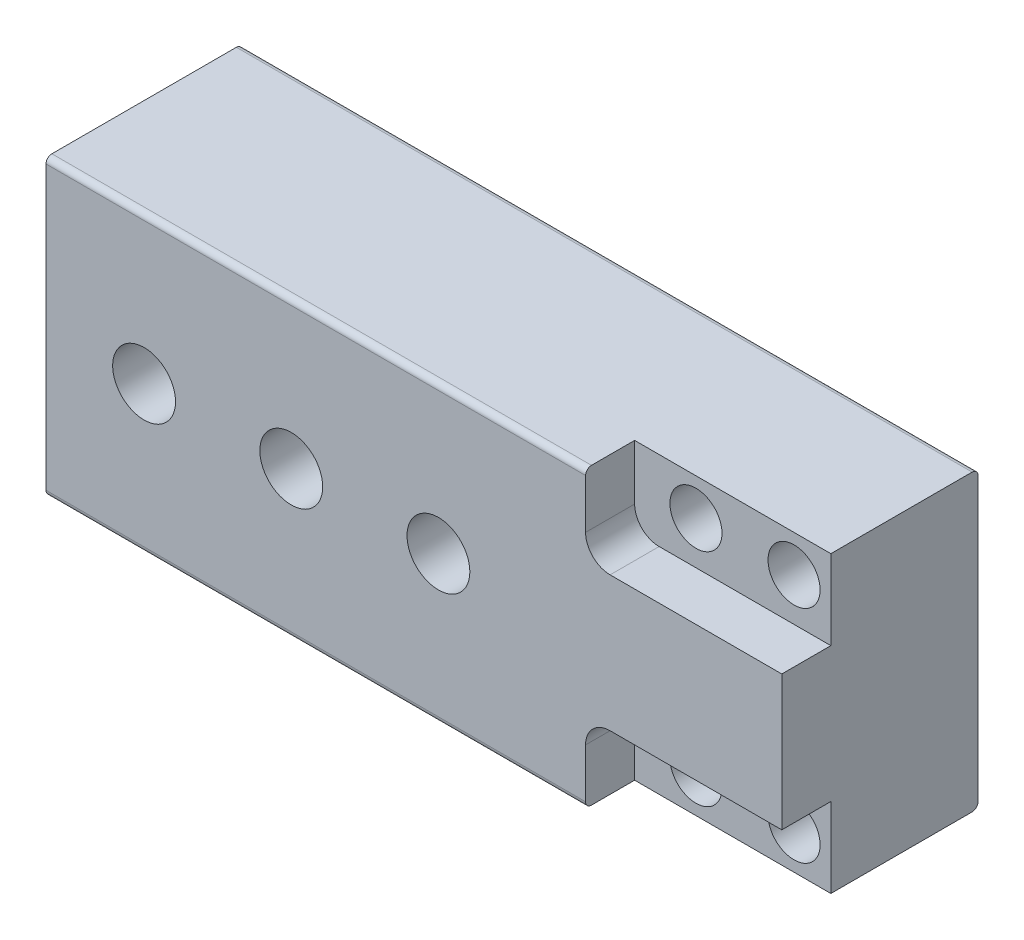
ISO-10303-21;
HEADER;
FILE_DESCRIPTION(('STEP AP214'),'2;1');
FILE_NAME('part.step','',(''),(''),'','','');
FILE_SCHEMA(('AUTOMOTIVE_DESIGN { 1 0 10303 214 1 1 1 1 }'));
ENDSEC;
DATA;
#1=APPLICATION_CONTEXT('core data for automotive mechanical design processes');
#2=APPLICATION_PROTOCOL_DEFINITION('international standard','automotive_design',2000,#1);
#3=PRODUCT_CONTEXT('',#1,'mechanical');
#4=PRODUCT('Part','Part','',(#3));
#5=PRODUCT_RELATED_PRODUCT_CATEGORY('part','',(#4));
#6=PRODUCT_DEFINITION_FORMATION('','',#4);
#7=PRODUCT_DEFINITION_CONTEXT('part definition',#1,'design');
#8=PRODUCT_DEFINITION('design','',#6,#7);
#9=PRODUCT_DEFINITION_SHAPE('','',#8);
#10=(LENGTH_UNIT() NAMED_UNIT(*) SI_UNIT(.MILLI.,.METRE.));
#11=(NAMED_UNIT(*) PLANE_ANGLE_UNIT() SI_UNIT($,.RADIAN.));
#12=(NAMED_UNIT(*) SI_UNIT($,.STERADIAN.) SOLID_ANGLE_UNIT());
#13=UNCERTAINTY_MEASURE_WITH_UNIT(LENGTH_MEASURE(1.E-05),#10,'distance_accuracy_value','');
#14=(GEOMETRIC_REPRESENTATION_CONTEXT(3) GLOBAL_UNCERTAINTY_ASSIGNED_CONTEXT((#13)) GLOBAL_UNIT_ASSIGNED_CONTEXT((#10,
#11,#12)) REPRESENTATION_CONTEXT('',''));
#15=CARTESIAN_POINT('',(0.,0.,0.));
#16=DIRECTION('',(0.,0.,1.));
#17=DIRECTION('',(1.,0.,0.));
#18=AXIS2_PLACEMENT_3D('',#15,#16,#17);
#19=CARTESIAN_POINT('',(85.725,28.575,50.8));
#20=DIRECTION('',(0.,0.,1.));
#21=DIRECTION('',(1.,0.,0.));
#22=AXIS2_PLACEMENT_3D('',#19,#20,#21);
#23=CYLINDRICAL_SURFACE('',#22,6.74369999999999);
#24=CARTESIAN_POINT('',(85.725,28.575,0.));
#25=DIRECTION('',(0.,0.,1.));
#26=DIRECTION('',(1.,0.,0.));
#27=AXIS2_PLACEMENT_3D('',#24,#25,#26);
#28=CIRCLE('',#27,6.74369999999999);
#29=CARTESIAN_POINT('',(92.4687,28.575,0.));
#30=VERTEX_POINT('',#29);
#31=EDGE_CURVE('E225',#30,#30,#28,.T.);
#32=ORIENTED_EDGE('',*,*,#31,.F.);
#33=EDGE_LOOP('',(#32));
#34=FACE_BOUND('',#33,.T.);
#35=CARTESIAN_POINT('',(85.725,28.575,38.1));
#36=DIRECTION('',(0.,0.,1.));
#37=DIRECTION('',(1.,0.,0.));
#38=AXIS2_PLACEMENT_3D('',#35,#36,#37);
#39=CIRCLE('',#38,6.74369999999999);
#40=CARTESIAN_POINT('',(92.4687,28.575,38.1));
#41=VERTEX_POINT('',#40);
#42=EDGE_CURVE('E219',#41,#41,#39,.F.);
#43=ORIENTED_EDGE('',*,*,#42,.F.);
#44=EDGE_LOOP('',(#43));
#45=FACE_BOUND('',#44,.T.);
#46=ADVANCED_FACE('F33',(#34,#45),#23,.F.);
#47=CARTESIAN_POINT('',(60.325,28.575,50.8));
#48=DIRECTION('',(0.,0.,1.));
#49=DIRECTION('',(1.,0.,0.));
#50=AXIS2_PLACEMENT_3D('',#47,#48,#49);
#51=CYLINDRICAL_SURFACE('',#50,6.74369999999999);
#52=CARTESIAN_POINT('',(60.325,28.575,0.));
#53=DIRECTION('',(0.,0.,1.));
#54=DIRECTION('',(1.,0.,0.));
#55=AXIS2_PLACEMENT_3D('',#52,#53,#54);
#56=CIRCLE('',#55,6.74369999999998);
#57=CARTESIAN_POINT('',(67.0687,28.575,0.));
#58=VERTEX_POINT('',#57);
#59=EDGE_CURVE('E222',#58,#58,#56,.T.);
#60=ORIENTED_EDGE('',*,*,#59,.F.);
#61=EDGE_LOOP('',(#60));
#62=FACE_BOUND('',#61,.T.);
#63=CARTESIAN_POINT('',(60.325,28.575,38.1));
#64=DIRECTION('',(0.,0.,1.));
#65=DIRECTION('',(1.,0.,0.));
#66=AXIS2_PLACEMENT_3D('',#63,#64,#65);
#67=CIRCLE('',#66,6.74369999999999);
#68=CARTESIAN_POINT('',(67.0687,28.575,38.1));
#69=VERTEX_POINT('',#68);
#70=EDGE_CURVE('E212',#69,#69,#67,.F.);
#71=ORIENTED_EDGE('',*,*,#70,.F.);
#72=EDGE_LOOP('',(#71));
#73=FACE_BOUND('',#72,.T.);
#74=ADVANCED_FACE('F327',(#62,#73),#51,.F.);
#75=CARTESIAN_POINT('',(-95.25,38.1,50.8));
#76=DIRECTION('',(1.,0.,0.));
#77=DIRECTION('',(0.,0.,-1.));
#78=AXIS2_PLACEMENT_3D('',#75,#76,#77);
#79=PLANE('',#78);
#80=DIRECTION('',(0.,0.,-1.));
#81=VECTOR('',#80,1.);
#82=CARTESIAN_POINT('',(-95.25,38.1,50.8));
#83=LINE('',#82,#81);
#84=CARTESIAN_POINT('',(-95.25,38.1,49.276));
#85=VERTEX_POINT('',#84);
#86=CARTESIAN_POINT('',(-95.25,38.1,1.524));
#87=VERTEX_POINT('',#86);
#88=EDGE_CURVE('E259',#85,#87,#83,.T.);
#89=ORIENTED_EDGE('',*,*,#88,.T.);
#90=CARTESIAN_POINT('',(-95.25,36.576,1.524));
#91=DIRECTION('',(1.,0.,0.));
#92=DIRECTION('',(0.,0.,-1.));
#93=AXIS2_PLACEMENT_3D('',#90,#91,#92);
#94=CIRCLE('',#93,1.524);
#95=CARTESIAN_POINT('',(-95.25,36.576,0.));
#96=VERTEX_POINT('',#95);
#97=EDGE_CURVE('E285',#87,#96,#94,.F.);
#98=ORIENTED_EDGE('',*,*,#97,.T.);
#99=DIRECTION('',(0.,-1.,0.));
#100=VECTOR('',#99,1.);
#101=CARTESIAN_POINT('',(-95.25,38.1,0.));
#102=LINE('',#101,#100);
#103=CARTESIAN_POINT('',(-95.25,-36.576,0.));
#104=VERTEX_POINT('',#103);
#105=EDGE_CURVE('E252',#96,#104,#102,.T.);
#106=ORIENTED_EDGE('',*,*,#105,.T.);
#107=CARTESIAN_POINT('',(-95.25,-36.576,1.524));
#108=DIRECTION('',(1.,0.,0.));
#109=DIRECTION('',(0.,0.,-1.));
#110=AXIS2_PLACEMENT_3D('',#107,#108,#109);
#111=CIRCLE('',#110,1.524);
#112=CARTESIAN_POINT('',(-95.25,-38.1,1.524));
#113=VERTEX_POINT('',#112);
#114=EDGE_CURVE('E283',#104,#113,#111,.F.);
#115=ORIENTED_EDGE('',*,*,#114,.T.);
#116=DIRECTION('',(0.,0.,-1.));
#117=VECTOR('',#116,1.);
#118=CARTESIAN_POINT('',(-95.25,-38.1,50.8));
#119=LINE('',#118,#117);
#120=CARTESIAN_POINT('',(-95.25,-38.1,49.276));
#121=VERTEX_POINT('',#120);
#122=EDGE_CURVE('E270',#121,#113,#119,.T.);
#123=ORIENTED_EDGE('',*,*,#122,.F.);
#124=CARTESIAN_POINT('',(-95.25,-36.576,49.276));
#125=DIRECTION('',(1.,0.,0.));
#126=DIRECTION('',(0.,0.,-1.));
#127=AXIS2_PLACEMENT_3D('',#124,#125,#126);
#128=CIRCLE('',#127,1.524);
#129=CARTESIAN_POINT('',(-95.25,-36.576,50.8));
#130=VERTEX_POINT('',#129);
#131=EDGE_CURVE('E279',#121,#130,#128,.F.);
#132=ORIENTED_EDGE('',*,*,#131,.T.);
#133=DIRECTION('',(0.,-1.,0.));
#134=VECTOR('',#133,1.);
#135=CARTESIAN_POINT('',(-95.25,38.1,50.8));
#136=LINE('',#135,#134);
#137=CARTESIAN_POINT('',(-95.25,36.576,50.8));
#138=VERTEX_POINT('',#137);
#139=EDGE_CURVE('E253',#138,#130,#136,.T.);
#140=ORIENTED_EDGE('',*,*,#139,.F.);
#141=CARTESIAN_POINT('',(-95.25,36.576,49.276));
#142=DIRECTION('',(1.,0.,0.));
#143=DIRECTION('',(0.,0.,-1.));
#144=AXIS2_PLACEMENT_3D('',#141,#142,#143);
#145=CIRCLE('',#144,1.524);
#146=EDGE_CURVE('E281',#138,#85,#145,.F.);
#147=ORIENTED_EDGE('',*,*,#146,.T.);
#148=EDGE_LOOP('',(#89,#98,#106,#115,#123,#132,#140,#147));
#149=FACE_BOUND('',#148,.T.);
#150=ADVANCED_FACE('F333',(#149),#79,.F.);
#151=CARTESIAN_POINT('',(-95.25,-38.1,50.8));
#152=DIRECTION('',(0.,1.,0.));
#153=DIRECTION('',(0.,0.,1.));
#154=AXIS2_PLACEMENT_3D('',#151,#152,#153);
#155=PLANE('',#154);
#156=DIRECTION('',(1.,0.,0.));
#157=VECTOR('',#156,1.);
#158=CARTESIAN_POINT('',(44.45,-38.1,38.1));
#159=LINE('',#158,#157);
#160=CARTESIAN_POINT('',(44.45,-38.1,38.1));
#161=VERTEX_POINT('',#160);
#162=CARTESIAN_POINT('',(95.25,-38.1,38.1));
#163=VERTEX_POINT('',#162);
#164=EDGE_CURVE('E162',#161,#163,#159,.T.);
#165=ORIENTED_EDGE('',*,*,#164,.F.);
#166=DIRECTION('',(0.,0.,1.));
#167=VECTOR('',#166,1.);
#168=CARTESIAN_POINT('',(44.45,-38.1,38.1));
#169=LINE('',#168,#167);
#170=CARTESIAN_POINT('',(44.45,-38.1,49.276));
#171=VERTEX_POINT('',#170);
#172=EDGE_CURVE('E153',#161,#171,#169,.T.);
#173=ORIENTED_EDGE('',*,*,#172,.T.);
#174=DIRECTION('',(1.,0.,0.));
#175=VECTOR('',#174,1.);
#176=CARTESIAN_POINT('',(-95.25,-38.1,49.276));
#177=LINE('',#176,#175);
#178=EDGE_CURVE('E296',#171,#121,#177,.F.);
#179=ORIENTED_EDGE('',*,*,#178,.T.);
#180=ORIENTED_EDGE('',*,*,#122,.T.);
#181=DIRECTION('',(1.,0.,0.));
#182=VECTOR('',#181,1.);
#183=CARTESIAN_POINT('',(-95.25,-38.1,1.524));
#184=LINE('',#183,#182);
#185=CARTESIAN_POINT('',(95.25,-38.1,1.524));
#186=VERTEX_POINT('',#185);
#187=EDGE_CURVE('E298',#113,#186,#184,.T.);
#188=ORIENTED_EDGE('',*,*,#187,.T.);
#189=DIRECTION('',(0.,0.,-1.));
#190=VECTOR('',#189,1.);
#191=CARTESIAN_POINT('',(95.25,-38.1,50.8));
#192=LINE('',#191,#190);
#193=EDGE_CURVE('E268',#163,#186,#192,.T.);
#194=ORIENTED_EDGE('',*,*,#193,.F.);
#195=EDGE_LOOP('',(#165,#173,#179,#180,#188,#194));
#196=FACE_BOUND('',#195,.T.);
#197=ADVANCED_FACE('F386',(#196),#155,.F.);
#198=CARTESIAN_POINT('',(95.25,38.1,50.8));
#199=DIRECTION('',(-1.,0.,0.));
#200=DIRECTION('',(0.,0.,1.));
#201=AXIS2_PLACEMENT_3D('',#198,#199,#200);
#202=PLANE('',#201);
#203=DIRECTION('',(0.,1.,0.));
#204=VECTOR('',#203,1.);
#205=CARTESIAN_POINT('',(95.25,38.1,50.8));
#206=LINE('',#205,#204);
#207=CARTESIAN_POINT('',(95.25,-17.4752,50.8));
#208=VERTEX_POINT('',#207);
#209=CARTESIAN_POINT('',(95.25,17.4752,50.8));
#210=VERTEX_POINT('',#209);
#211=EDGE_CURVE('E256',#208,#210,#206,.T.);
#212=ORIENTED_EDGE('',*,*,#211,.F.);
#213=DIRECTION('',(0.,0.,1.));
#214=VECTOR('',#213,1.);
#215=CARTESIAN_POINT('',(95.25,-17.4752,38.1));
#216=LINE('',#215,#214);
#217=CARTESIAN_POINT('',(95.25,-17.4752,38.1));
#218=VERTEX_POINT('',#217);
#219=EDGE_CURVE('E181',#218,#208,#216,.T.);
#220=ORIENTED_EDGE('',*,*,#219,.F.);
#221=DIRECTION('',(0.,1.,0.));
#222=VECTOR('',#221,1.);
#223=CARTESIAN_POINT('',(95.25,-17.4752,38.1));
#224=LINE('',#223,#222);
#225=EDGE_CURVE('E173',#163,#218,#224,.T.);
#226=ORIENTED_EDGE('',*,*,#225,.F.);
#227=ORIENTED_EDGE('',*,*,#193,.T.);
#228=CARTESIAN_POINT('',(95.25,-36.576,1.524));
#229=DIRECTION('',(-1.,0.,0.));
#230=DIRECTION('',(0.,0.,1.));
#231=AXIS2_PLACEMENT_3D('',#228,#229,#230);
#232=CIRCLE('',#231,1.524);
#233=CARTESIAN_POINT('',(95.25,-36.576,0.));
#234=VERTEX_POINT('',#233);
#235=EDGE_CURVE('E291',#186,#234,#232,.F.);
#236=ORIENTED_EDGE('',*,*,#235,.T.);
#237=DIRECTION('',(0.,1.,0.));
#238=VECTOR('',#237,1.);
#239=CARTESIAN_POINT('',(95.25,38.1,0.));
#240=LINE('',#239,#238);
#241=CARTESIAN_POINT('',(95.25,36.576,0.));
#242=VERTEX_POINT('',#241);
#243=EDGE_CURVE('E257',#234,#242,#240,.T.);
#244=ORIENTED_EDGE('',*,*,#243,.T.);
#245=CARTESIAN_POINT('',(95.25,36.576,1.524));
#246=DIRECTION('',(-1.,0.,0.));
#247=DIRECTION('',(0.,0.,1.));
#248=AXIS2_PLACEMENT_3D('',#245,#246,#247);
#249=CIRCLE('',#248,1.524);
#250=CARTESIAN_POINT('',(95.25,38.1,1.524));
#251=VERTEX_POINT('',#250);
#252=EDGE_CURVE('E293',#242,#251,#249,.F.);
#253=ORIENTED_EDGE('',*,*,#252,.T.);
#254=DIRECTION('',(0.,0.,-1.));
#255=VECTOR('',#254,1.);
#256=CARTESIAN_POINT('',(95.25,38.1,50.8));
#257=LINE('',#256,#255);
#258=CARTESIAN_POINT('',(95.25,38.1,38.1));
#259=VERTEX_POINT('',#258);
#260=EDGE_CURVE('E266',#259,#251,#257,.T.);
#261=ORIENTED_EDGE('',*,*,#260,.F.);
#262=DIRECTION('',(0.,1.,0.));
#263=VECTOR('',#262,1.);
#264=CARTESIAN_POINT('',(95.25,38.1,38.1));
#265=LINE('',#264,#263);
#266=CARTESIAN_POINT('',(95.25,17.4752,38.1));
#267=VERTEX_POINT('',#266);
#268=EDGE_CURVE('E188',#267,#259,#265,.T.);
#269=ORIENTED_EDGE('',*,*,#268,.F.);
#270=DIRECTION('',(0.,0.,1.));
#271=VECTOR('',#270,1.);
#272=CARTESIAN_POINT('',(95.25,17.4752,38.1));
#273=LINE('',#272,#271);
#274=EDGE_CURVE('E209',#267,#210,#273,.T.);
#275=ORIENTED_EDGE('',*,*,#274,.T.);
#276=EDGE_LOOP('',(#212,#220,#226,#227,#236,#244,#253,#261,#269,#275));
#277=FACE_BOUND('',#276,.T.);
#278=ADVANCED_FACE('F382',(#277),#202,.F.);
#279=CARTESIAN_POINT('',(-95.25,38.1,50.8));
#280=DIRECTION('',(0.,-1.,0.));
#281=DIRECTION('',(0.,0.,-1.));
#282=AXIS2_PLACEMENT_3D('',#279,#280,#281);
#283=PLANE('',#282);
#284=DIRECTION('',(-1.,0.,0.));
#285=VECTOR('',#284,1.);
#286=CARTESIAN_POINT('',(95.25,38.1,49.276));
#287=LINE('',#286,#285);
#288=CARTESIAN_POINT('',(44.45,38.1,49.276));
#289=VERTEX_POINT('',#288);
#290=EDGE_CURVE('E273',#85,#289,#287,.F.);
#291=ORIENTED_EDGE('',*,*,#290,.T.);
#292=DIRECTION('',(0.,0.,1.));
#293=VECTOR('',#292,1.);
#294=CARTESIAN_POINT('',(44.45,38.1,38.1));
#295=LINE('',#294,#293);
#296=CARTESIAN_POINT('',(44.45,38.1,38.1));
#297=VERTEX_POINT('',#296);
#298=EDGE_CURVE('E55',#297,#289,#295,.T.);
#299=ORIENTED_EDGE('',*,*,#298,.F.);
#300=DIRECTION('',(-1.,0.,0.));
#301=VECTOR('',#300,1.);
#302=CARTESIAN_POINT('',(95.25,38.1,38.1));
#303=LINE('',#302,#301);
#304=EDGE_CURVE('E190',#259,#297,#303,.T.);
#305=ORIENTED_EDGE('',*,*,#304,.F.);
#306=ORIENTED_EDGE('',*,*,#260,.T.);
#307=DIRECTION('',(-1.,0.,0.));
#308=VECTOR('',#307,1.);
#309=CARTESIAN_POINT('',(-95.25,38.1,1.524));
#310=LINE('',#309,#308);
#311=EDGE_CURVE('E276',#251,#87,#310,.T.);
#312=ORIENTED_EDGE('',*,*,#311,.T.);
#313=ORIENTED_EDGE('',*,*,#88,.F.);
#314=EDGE_LOOP('',(#291,#299,#305,#306,#312,#313));
#315=FACE_BOUND('',#314,.T.);
#316=ADVANCED_FACE('F374',(#315),#283,.F.);
#317=CARTESIAN_POINT('',(-95.25,-38.1,50.8));
#318=DIRECTION('',(0.,0.,1.));
#319=DIRECTION('',(1.,0.,0.));
#320=AXIS2_PLACEMENT_3D('',#317,#318,#319);
#321=PLANE('',#320);
#322=DIRECTION('',(-1.,0.,0.));
#323=VECTOR('',#322,1.);
#324=CARTESIAN_POINT('',(50.8,-17.4752,50.8));
#325=LINE('',#324,#323);
#326=CARTESIAN_POINT('',(50.8,-17.4752,50.8));
#327=VERTEX_POINT('',#326);
#328=EDGE_CURVE('E167',#208,#327,#325,.T.);
#329=ORIENTED_EDGE('',*,*,#328,.F.);
#330=ORIENTED_EDGE('',*,*,#211,.T.);
#331=DIRECTION('',(1.,0.,0.));
#332=VECTOR('',#331,1.);
#333=CARTESIAN_POINT('',(95.25,17.4752,50.8));
#334=LINE('',#333,#332);
#335=CARTESIAN_POINT('',(50.8,17.4752,50.8));
#336=VERTEX_POINT('',#335);
#337=EDGE_CURVE('E191',#336,#210,#334,.T.);
#338=ORIENTED_EDGE('',*,*,#337,.F.);
#339=CARTESIAN_POINT('',(50.8,23.8252,50.8));
#340=DIRECTION('',(0.,0.,1.));
#341=DIRECTION('',(1.,0.,0.));
#342=AXIS2_PLACEMENT_3D('',#339,#340,#341);
#343=CIRCLE('',#342,6.34999999999999);
#344=CARTESIAN_POINT('',(44.45,23.8252,50.8));
#345=VERTEX_POINT('',#344);
#346=EDGE_CURVE('E204',#345,#336,#343,.T.);
#347=ORIENTED_EDGE('',*,*,#346,.F.);
#348=DIRECTION('',(0.,-1.,0.));
#349=VECTOR('',#348,1.);
#350=CARTESIAN_POINT('',(44.45,38.1,50.8));
#351=LINE('',#350,#349);
#352=CARTESIAN_POINT('',(44.45,36.576,50.8));
#353=VERTEX_POINT('',#352);
#354=EDGE_CURVE('E187',#353,#345,#351,.T.);
#355=ORIENTED_EDGE('',*,*,#354,.F.);
#356=DIRECTION('',(-1.,0.,0.));
#357=VECTOR('',#356,1.);
#358=CARTESIAN_POINT('',(-95.25,36.576,50.8));
#359=LINE('',#358,#357);
#360=EDGE_CURVE('E304',#353,#138,#359,.T.);
#361=ORIENTED_EDGE('',*,*,#360,.T.);
#362=ORIENTED_EDGE('',*,*,#139,.T.);
#363=DIRECTION('',(1.,0.,0.));
#364=VECTOR('',#363,1.);
#365=CARTESIAN_POINT('',(95.25,-36.576,50.8));
#366=LINE('',#365,#364);
#367=CARTESIAN_POINT('',(44.45,-36.576,50.8));
#368=VERTEX_POINT('',#367);
#369=EDGE_CURVE('E301',#130,#368,#366,.T.);
#370=ORIENTED_EDGE('',*,*,#369,.T.);
#371=DIRECTION('',(0.,-1.,0.));
#372=VECTOR('',#371,1.);
#373=CARTESIAN_POINT('',(44.45,-23.8252,50.8));
#374=LINE('',#373,#372);
#375=CARTESIAN_POINT('',(44.45,-23.8252,50.8));
#376=VERTEX_POINT('',#375);
#377=EDGE_CURVE('E47',#376,#368,#374,.T.);
#378=ORIENTED_EDGE('',*,*,#377,.F.);
#379=CARTESIAN_POINT('',(50.8,-23.8252,50.8));
#380=DIRECTION('',(0.,0.,1.));
#381=DIRECTION('',(-1.,0.,0.));
#382=AXIS2_PLACEMENT_3D('',#379,#380,#381);
#383=CIRCLE('',#382,6.35);
#384=EDGE_CURVE('E152',#327,#376,#383,.T.);
#385=ORIENTED_EDGE('',*,*,#384,.F.);
#386=EDGE_LOOP('',(#329,#330,#338,#347,#355,#361,#362,#370,#378,#385));
#387=FACE_BOUND('',#386,.T.);
#388=CARTESIAN_POINT('',(-69.85,0.,50.8));
#389=DIRECTION('',(0.,0.,1.));
#390=DIRECTION('',(1.,0.,0.));
#391=AXIS2_PLACEMENT_3D('',#388,#389,#390);
#392=CIRCLE('',#391,8.136001);
#393=CARTESIAN_POINT('',(-61.713999,0.,50.8));
#394=VERTEX_POINT('',#393);
#395=EDGE_CURVE('E234',#394,#394,#392,.T.);
#396=ORIENTED_EDGE('',*,*,#395,.F.);
#397=EDGE_LOOP('',(#396));
#398=FACE_BOUND('',#397,.T.);
#399=CARTESIAN_POINT('',(-31.75,0.,50.8));
#400=DIRECTION('',(0.,0.,1.));
#401=DIRECTION('',(1.,0.,0.));
#402=AXIS2_PLACEMENT_3D('',#399,#400,#401);
#403=CIRCLE('',#402,8.136001);
#404=CARTESIAN_POINT('',(-23.613999,0.,50.8));
#405=VERTEX_POINT('',#404);
#406=EDGE_CURVE('E240',#405,#405,#403,.T.);
#407=ORIENTED_EDGE('',*,*,#406,.F.);
#408=EDGE_LOOP('',(#407));
#409=FACE_BOUND('',#408,.T.);
#410=CARTESIAN_POINT('',(6.35000000000001,0.,50.8));
#411=DIRECTION('',(0.,0.,1.));
#412=DIRECTION('',(1.,0.,0.));
#413=AXIS2_PLACEMENT_3D('',#410,#411,#412);
#414=CIRCLE('',#413,8.136001);
#415=CARTESIAN_POINT('',(14.486001,0.,50.8));
#416=VERTEX_POINT('',#415);
#417=EDGE_CURVE('E246',#416,#416,#414,.T.);
#418=ORIENTED_EDGE('',*,*,#417,.F.);
#419=EDGE_LOOP('',(#418));
#420=FACE_BOUND('',#419,.T.);
#421=ADVANCED_FACE('F370',(#387,#398,#409,#420),#321,.T.);
#422=CARTESIAN_POINT('',(-95.25,-38.1,0.));
#423=DIRECTION('',(0.,0.,1.));
#424=DIRECTION('',(1.,0.,0.));
#425=AXIS2_PLACEMENT_3D('',#422,#423,#424);
#426=PLANE('',#425);
#427=ORIENTED_EDGE('',*,*,#59,.T.);
#428=EDGE_LOOP('',(#427));
#429=FACE_BOUND('',#428,.T.);
#430=ORIENTED_EDGE('',*,*,#31,.T.);
#431=EDGE_LOOP('',(#430));
#432=FACE_BOUND('',#431,.T.);
#433=CARTESIAN_POINT('',(60.325,-28.575,0.));
#434=DIRECTION('',(0.,0.,1.));
#435=DIRECTION('',(1.,0.,0.));
#436=AXIS2_PLACEMENT_3D('',#433,#434,#435);
#437=CIRCLE('',#436,6.74369999999998);
#438=CARTESIAN_POINT('',(67.0687,-28.575,0.));
#439=VERTEX_POINT('',#438);
#440=EDGE_CURVE('E228',#439,#439,#437,.T.);
#441=ORIENTED_EDGE('',*,*,#440,.T.);
#442=EDGE_LOOP('',(#441));
#443=FACE_BOUND('',#442,.T.);
#444=CARTESIAN_POINT('',(85.725,-28.575,0.));
#445=DIRECTION('',(0.,0.,1.));
#446=DIRECTION('',(1.,0.,0.));
#447=AXIS2_PLACEMENT_3D('',#444,#445,#446);
#448=CIRCLE('',#447,6.74369999999999);
#449=CARTESIAN_POINT('',(92.4687,-28.575,0.));
#450=VERTEX_POINT('',#449);
#451=EDGE_CURVE('E231',#450,#450,#448,.T.);
#452=ORIENTED_EDGE('',*,*,#451,.T.);
#453=EDGE_LOOP('',(#452));
#454=FACE_BOUND('',#453,.T.);
#455=ORIENTED_EDGE('',*,*,#105,.F.);
#456=DIRECTION('',(-1.,0.,0.));
#457=VECTOR('',#456,1.);
#458=CARTESIAN_POINT('',(-95.25,36.576,0.));
#459=LINE('',#458,#457);
#460=EDGE_CURVE('E289',#96,#242,#459,.F.);
#461=ORIENTED_EDGE('',*,*,#460,.T.);
#462=ORIENTED_EDGE('',*,*,#243,.F.);
#463=DIRECTION('',(1.,0.,0.));
#464=VECTOR('',#463,1.);
#465=CARTESIAN_POINT('',(-95.25,-36.576,0.));
#466=LINE('',#465,#464);
#467=EDGE_CURVE('E287',#234,#104,#466,.F.);
#468=ORIENTED_EDGE('',*,*,#467,.T.);
#469=EDGE_LOOP('',(#455,#461,#462,#468));
#470=FACE_BOUND('',#469,.T.);
#471=ADVANCED_FACE('F373',(#429,#432,#443,#454,#470),#426,.F.);
#472=CARTESIAN_POINT('',(-95.25,36.576,1.524));
#473=DIRECTION('',(-1.,0.,0.));
#474=DIRECTION('',(0.,0.,1.));
#475=AXIS2_PLACEMENT_3D('',#472,#473,#474);
#476=CYLINDRICAL_SURFACE('',#475,1.524);
#477=ORIENTED_EDGE('',*,*,#252,.F.);
#478=ORIENTED_EDGE('',*,*,#460,.F.);
#479=ORIENTED_EDGE('',*,*,#97,.F.);
#480=ORIENTED_EDGE('',*,*,#311,.F.);
#481=EDGE_LOOP('',(#477,#478,#479,#480));
#482=FACE_BOUND('',#481,.T.);
#483=ADVANCED_FACE('F378',(#482),#476,.T.);
#484=CARTESIAN_POINT('',(-95.25,-36.576,1.524));
#485=DIRECTION('',(1.,0.,0.));
#486=DIRECTION('',(0.,0.,-1.));
#487=AXIS2_PLACEMENT_3D('',#484,#485,#486);
#488=CYLINDRICAL_SURFACE('',#487,1.524);
#489=ORIENTED_EDGE('',*,*,#114,.F.);
#490=ORIENTED_EDGE('',*,*,#467,.F.);
#491=ORIENTED_EDGE('',*,*,#235,.F.);
#492=ORIENTED_EDGE('',*,*,#187,.F.);
#493=EDGE_LOOP('',(#489,#490,#491,#492));
#494=FACE_BOUND('',#493,.T.);
#495=ADVANCED_FACE('F396',(#494),#488,.T.);
#496=CARTESIAN_POINT('',(-95.25,36.576,49.276));
#497=DIRECTION('',(1.,0.,0.));
#498=DIRECTION('',(0.,0.,-1.));
#499=AXIS2_PLACEMENT_3D('',#496,#497,#498);
#500=CYLINDRICAL_SURFACE('',#499,1.524);
#501=CARTESIAN_POINT('',(44.45,36.576,49.276));
#502=DIRECTION('',(-1.,0.,0.));
#503=DIRECTION('',(0.,-1.,0.));
#504=AXIS2_PLACEMENT_3D('',#501,#502,#503);
#505=CIRCLE('',#504,1.524);
#506=EDGE_CURVE('E41',#289,#353,#505,.F.);
#507=ORIENTED_EDGE('',*,*,#506,.F.);
#508=ORIENTED_EDGE('',*,*,#290,.F.);
#509=ORIENTED_EDGE('',*,*,#146,.F.);
#510=ORIENTED_EDGE('',*,*,#360,.F.);
#511=EDGE_LOOP('',(#507,#508,#509,#510));
#512=FACE_BOUND('',#511,.T.);
#513=ADVANCED_FACE('F399',(#512),#500,.T.);
#514=CARTESIAN_POINT('',(-95.25,-36.576,49.276));
#515=DIRECTION('',(-1.,0.,0.));
#516=DIRECTION('',(0.,0.,1.));
#517=AXIS2_PLACEMENT_3D('',#514,#515,#516);
#518=CYLINDRICAL_SURFACE('',#517,1.524);
#519=CARTESIAN_POINT('',(44.45,-36.576,49.276));
#520=DIRECTION('',(-1.,0.,0.));
#521=DIRECTION('',(0.,0.,1.));
#522=AXIS2_PLACEMENT_3D('',#519,#520,#521);
#523=CIRCLE('',#522,1.524);
#524=EDGE_CURVE('E11',#368,#171,#523,.F.);
#525=ORIENTED_EDGE('',*,*,#524,.F.);
#526=ORIENTED_EDGE('',*,*,#369,.F.);
#527=ORIENTED_EDGE('',*,*,#131,.F.);
#528=ORIENTED_EDGE('',*,*,#178,.F.);
#529=EDGE_LOOP('',(#525,#526,#527,#528));
#530=FACE_BOUND('',#529,.T.);
#531=ADVANCED_FACE('F35',(#530),#518,.T.);
#532=CARTESIAN_POINT('',(6.35,0.,24.638));
#533=DIRECTION('',(0.,0.,-1.));
#534=DIRECTION('',(-1.,0.,0.));
#535=AXIS2_PLACEMENT_3D('',#532,#533,#534);
#536=PLANE('',#535);
#537=CARTESIAN_POINT('',(6.35000000000001,0.,24.638));
#538=DIRECTION('',(0.,0.,1.));
#539=DIRECTION('',(1.,0.,0.));
#540=AXIS2_PLACEMENT_3D('',#537,#538,#539);
#541=CIRCLE('',#540,8.13600099999999);
#542=CARTESIAN_POINT('',(14.486001,0.,24.638));
#543=VERTEX_POINT('',#542);
#544=EDGE_CURVE('E249',#543,#543,#541,.T.);
#545=ORIENTED_EDGE('',*,*,#544,.T.);
#546=EDGE_LOOP('',(#545));
#547=FACE_BOUND('',#546,.T.);
#548=ADVANCED_FACE('F365',(#547),#536,.F.);
#549=CARTESIAN_POINT('',(6.35000000000001,0.,50.8));
#550=DIRECTION('',(0.,0.,1.));
#551=DIRECTION('',(1.,0.,0.));
#552=AXIS2_PLACEMENT_3D('',#549,#550,#551);
#553=CYLINDRICAL_SURFACE('',#552,8.13600099999999);
#554=ORIENTED_EDGE('',*,*,#544,.F.);
#555=EDGE_LOOP('',(#554));
#556=FACE_BOUND('',#555,.T.);
#557=ORIENTED_EDGE('',*,*,#417,.T.);
#558=EDGE_LOOP('',(#557));
#559=FACE_BOUND('',#558,.T.);
#560=ADVANCED_FACE('F361',(#556,#559),#553,.F.);
#561=CARTESIAN_POINT('',(-31.75,0.,24.638));
#562=DIRECTION('',(0.,0.,-1.));
#563=DIRECTION('',(-1.,0.,0.));
#564=AXIS2_PLACEMENT_3D('',#561,#562,#563);
#565=PLANE('',#564);
#566=CARTESIAN_POINT('',(-31.75,0.,24.638));
#567=DIRECTION('',(0.,0.,1.));
#568=DIRECTION('',(1.,0.,0.));
#569=AXIS2_PLACEMENT_3D('',#566,#567,#568);
#570=CIRCLE('',#569,8.13600099999999);
#571=CARTESIAN_POINT('',(-23.613999,0.,24.638));
#572=VERTEX_POINT('',#571);
#573=EDGE_CURVE('E243',#572,#572,#570,.T.);
#574=ORIENTED_EDGE('',*,*,#573,.T.);
#575=EDGE_LOOP('',(#574));
#576=FACE_BOUND('',#575,.T.);
#577=ADVANCED_FACE('F357',(#576),#565,.F.);
#578=CARTESIAN_POINT('',(-31.75,0.,50.8));
#579=DIRECTION('',(0.,0.,1.));
#580=DIRECTION('',(1.,0.,0.));
#581=AXIS2_PLACEMENT_3D('',#578,#579,#580);
#582=CYLINDRICAL_SURFACE('',#581,8.13600099999999);
#583=ORIENTED_EDGE('',*,*,#573,.F.);
#584=EDGE_LOOP('',(#583));
#585=FACE_BOUND('',#584,.T.);
#586=ORIENTED_EDGE('',*,*,#406,.T.);
#587=EDGE_LOOP('',(#586));
#588=FACE_BOUND('',#587,.T.);
#589=ADVANCED_FACE('F353',(#585,#588),#582,.F.);
#590=CARTESIAN_POINT('',(-69.85,0.,24.638));
#591=DIRECTION('',(0.,0.,-1.));
#592=DIRECTION('',(-1.,0.,0.));
#593=AXIS2_PLACEMENT_3D('',#590,#591,#592);
#594=PLANE('',#593);
#595=CARTESIAN_POINT('',(-69.85,0.,24.638));
#596=DIRECTION('',(0.,0.,1.));
#597=DIRECTION('',(1.,0.,0.));
#598=AXIS2_PLACEMENT_3D('',#595,#596,#597);
#599=CIRCLE('',#598,8.13600099999999);
#600=CARTESIAN_POINT('',(-61.713999,0.,24.638));
#601=VERTEX_POINT('',#600);
#602=EDGE_CURVE('E237',#601,#601,#599,.T.);
#603=ORIENTED_EDGE('',*,*,#602,.T.);
#604=EDGE_LOOP('',(#603));
#605=FACE_BOUND('',#604,.T.);
#606=ADVANCED_FACE('F349',(#605),#594,.F.);
#607=CARTESIAN_POINT('',(-69.85,0.,50.8));
#608=DIRECTION('',(0.,0.,1.));
#609=DIRECTION('',(1.,0.,0.));
#610=AXIS2_PLACEMENT_3D('',#607,#608,#609);
#611=CYLINDRICAL_SURFACE('',#610,8.13600099999999);
#612=ORIENTED_EDGE('',*,*,#602,.F.);
#613=EDGE_LOOP('',(#612));
#614=FACE_BOUND('',#613,.T.);
#615=ORIENTED_EDGE('',*,*,#395,.T.);
#616=EDGE_LOOP('',(#615));
#617=FACE_BOUND('',#616,.T.);
#618=ADVANCED_FACE('F345',(#614,#617),#611,.F.);
#619=CARTESIAN_POINT('',(85.725,-28.575,50.8));
#620=DIRECTION('',(0.,0.,1.));
#621=DIRECTION('',(1.,0.,0.));
#622=AXIS2_PLACEMENT_3D('',#619,#620,#621);
#623=CYLINDRICAL_SURFACE('',#622,6.74369999999999);
#624=CARTESIAN_POINT('',(85.725,-28.575,38.1));
#625=DIRECTION('',(0.,0.,-1.));
#626=DIRECTION('',(-1.,0.,0.));
#627=AXIS2_PLACEMENT_3D('',#624,#625,#626);
#628=CIRCLE('',#627,6.74369999999999);
#629=CARTESIAN_POINT('',(78.9813,-28.575,38.1));
#630=VERTEX_POINT('',#629);
#631=EDGE_CURVE('E184',#630,#630,#628,.F.);
#632=ORIENTED_EDGE('',*,*,#631,.T.);
#633=EDGE_LOOP('',(#632));
#634=FACE_BOUND('',#633,.T.);
#635=ORIENTED_EDGE('',*,*,#451,.F.);
#636=EDGE_LOOP('',(#635));
#637=FACE_BOUND('',#636,.T.);
#638=ADVANCED_FACE('F342',(#634,#637),#623,.F.);
#639=CARTESIAN_POINT('',(60.325,-28.575,50.8));
#640=DIRECTION('',(0.,0.,1.));
#641=DIRECTION('',(1.,0.,0.));
#642=AXIS2_PLACEMENT_3D('',#639,#640,#641);
#643=CYLINDRICAL_SURFACE('',#642,6.74369999999999);
#644=CARTESIAN_POINT('',(60.325,-28.575,38.1));
#645=DIRECTION('',(0.,0.,-1.));
#646=DIRECTION('',(-1.,0.,0.));
#647=AXIS2_PLACEMENT_3D('',#644,#645,#646);
#648=CIRCLE('',#647,6.74369999999999);
#649=CARTESIAN_POINT('',(53.5813,-28.575,38.1));
#650=VERTEX_POINT('',#649);
#651=EDGE_CURVE('E180',#650,#650,#648,.F.);
#652=ORIENTED_EDGE('',*,*,#651,.T.);
#653=EDGE_LOOP('',(#652));
#654=FACE_BOUND('',#653,.T.);
#655=ORIENTED_EDGE('',*,*,#440,.F.);
#656=EDGE_LOOP('',(#655));
#657=FACE_BOUND('',#656,.T.);
#658=ADVANCED_FACE('F311',(#654,#657),#643,.F.);
#659=CARTESIAN_POINT('',(50.8,23.8252,38.1));
#660=DIRECTION('',(0.,0.,1.));
#661=DIRECTION('',(1.,0.,0.));
#662=AXIS2_PLACEMENT_3D('',#659,#660,#661);
#663=PLANE('',#662);
#664=ORIENTED_EDGE('',*,*,#70,.T.);
#665=EDGE_LOOP('',(#664));
#666=FACE_BOUND('',#665,.T.);
#667=ORIENTED_EDGE('',*,*,#268,.T.);
#668=ORIENTED_EDGE('',*,*,#304,.T.);
#669=DIRECTION('',(0.,-1.,0.));
#670=VECTOR('',#669,1.);
#671=CARTESIAN_POINT('',(44.45,38.1,38.1));
#672=LINE('',#671,#670);
#673=CARTESIAN_POINT('',(44.45,23.8252,38.1));
#674=VERTEX_POINT('',#673);
#675=EDGE_CURVE('E194',#297,#674,#672,.T.);
#676=ORIENTED_EDGE('',*,*,#675,.T.);
#677=CARTESIAN_POINT('',(50.8,23.8252,38.1));
#678=DIRECTION('',(0.,0.,1.));
#679=DIRECTION('',(1.,0.,0.));
#680=AXIS2_PLACEMENT_3D('',#677,#678,#679);
#681=CIRCLE('',#680,6.34999999999999);
#682=CARTESIAN_POINT('',(50.8,17.4752,38.1));
#683=VERTEX_POINT('',#682);
#684=EDGE_CURVE('E197',#674,#683,#681,.T.);
#685=ORIENTED_EDGE('',*,*,#684,.T.);
#686=DIRECTION('',(1.,0.,0.));
#687=VECTOR('',#686,1.);
#688=CARTESIAN_POINT('',(95.25,17.4752,38.1));
#689=LINE('',#688,#687);
#690=EDGE_CURVE('E200',#683,#267,#689,.T.);
#691=ORIENTED_EDGE('',*,*,#690,.T.);
#692=EDGE_LOOP('',(#667,#668,#676,#685,#691));
#693=FACE_BOUND('',#692,.T.);
#694=ORIENTED_EDGE('',*,*,#42,.T.);
#695=EDGE_LOOP('',(#694));
#696=FACE_BOUND('',#695,.T.);
#697=ADVANCED_FACE('F341',(#666,#693,#696),#663,.T.);
#698=CARTESIAN_POINT('',(95.25,17.4752,38.1));
#699=DIRECTION('',(0.,-1.,0.));
#700=DIRECTION('',(1.,0.,0.));
#701=AXIS2_PLACEMENT_3D('',#698,#699,#700);
#702=PLANE('',#701);
#703=ORIENTED_EDGE('',*,*,#337,.T.);
#704=ORIENTED_EDGE('',*,*,#274,.F.);
#705=ORIENTED_EDGE('',*,*,#690,.F.);
#706=DIRECTION('',(0.,0.,1.));
#707=VECTOR('',#706,1.);
#708=CARTESIAN_POINT('',(50.8,17.4752,38.1));
#709=LINE('',#708,#707);
#710=EDGE_CURVE('E213',#683,#336,#709,.T.);
#711=ORIENTED_EDGE('',*,*,#710,.T.);
#712=EDGE_LOOP('',(#703,#704,#705,#711));
#713=FACE_BOUND('',#712,.T.);
#714=ADVANCED_FACE('F431',(#713),#702,.F.);
#715=CARTESIAN_POINT('',(50.8,23.8252,38.1));
#716=DIRECTION('',(0.,0.,1.));
#717=DIRECTION('',(1.,0.,0.));
#718=AXIS2_PLACEMENT_3D('',#715,#716,#717);
#719=CYLINDRICAL_SURFACE('',#718,6.34999999999999);
#720=ORIENTED_EDGE('',*,*,#346,.T.);
#721=ORIENTED_EDGE('',*,*,#710,.F.);
#722=ORIENTED_EDGE('',*,*,#684,.F.);
#723=DIRECTION('',(0.,0.,1.));
#724=VECTOR('',#723,1.);
#725=CARTESIAN_POINT('',(44.45,23.8252,38.1));
#726=LINE('',#725,#724);
#727=EDGE_CURVE('E215',#674,#345,#726,.T.);
#728=ORIENTED_EDGE('',*,*,#727,.T.);
#729=EDGE_LOOP('',(#720,#721,#722,#728));
#730=FACE_BOUND('',#729,.T.);
#731=ADVANCED_FACE('F323',(#730),#719,.F.);
#732=CARTESIAN_POINT('',(44.45,38.1,38.1));
#733=DIRECTION('',(-1.,0.,0.));
#734=DIRECTION('',(0.,-1.,0.));
#735=AXIS2_PLACEMENT_3D('',#732,#733,#734);
#736=PLANE('',#735);
#737=ORIENTED_EDGE('',*,*,#506,.T.);
#738=ORIENTED_EDGE('',*,*,#354,.T.);
#739=ORIENTED_EDGE('',*,*,#727,.F.);
#740=ORIENTED_EDGE('',*,*,#675,.F.);
#741=ORIENTED_EDGE('',*,*,#298,.T.);
#742=EDGE_LOOP('',(#737,#738,#739,#740,#741));
#743=FACE_BOUND('',#742,.T.);
#744=ADVANCED_FACE('F315',(#743),#736,.F.);
#745=CARTESIAN_POINT('',(50.8,-23.8252,38.1));
#746=DIRECTION('',(0.,0.,-1.));
#747=DIRECTION('',(-1.,0.,0.));
#748=AXIS2_PLACEMENT_3D('',#745,#746,#747);
#749=PLANE('',#748);
#750=ORIENTED_EDGE('',*,*,#651,.F.);
#751=EDGE_LOOP('',(#750));
#752=FACE_BOUND('',#751,.T.);
#753=CARTESIAN_POINT('',(50.8,-23.8252,38.1));
#754=DIRECTION('',(0.,0.,1.));
#755=DIRECTION('',(-1.,0.,0.));
#756=AXIS2_PLACEMENT_3D('',#753,#754,#755);
#757=CIRCLE('',#756,6.35);
#758=CARTESIAN_POINT('',(50.8,-17.4752,38.1));
#759=VERTEX_POINT('',#758);
#760=CARTESIAN_POINT('',(44.45,-23.8252,38.1));
#761=VERTEX_POINT('',#760);
#762=EDGE_CURVE('E149',#759,#761,#757,.T.);
#763=ORIENTED_EDGE('',*,*,#762,.T.);
#764=DIRECTION('',(0.,-1.,0.));
#765=VECTOR('',#764,1.);
#766=CARTESIAN_POINT('',(44.45,-23.8252,38.1));
#767=LINE('',#766,#765);
#768=EDGE_CURVE('E157',#761,#161,#767,.T.);
#769=ORIENTED_EDGE('',*,*,#768,.T.);
#770=ORIENTED_EDGE('',*,*,#164,.T.);
#771=ORIENTED_EDGE('',*,*,#225,.T.);
#772=DIRECTION('',(-1.,0.,0.));
#773=VECTOR('',#772,1.);
#774=CARTESIAN_POINT('',(50.8,-17.4752,38.1));
#775=LINE('',#774,#773);
#776=EDGE_CURVE('E154',#218,#759,#775,.T.);
#777=ORIENTED_EDGE('',*,*,#776,.T.);
#778=EDGE_LOOP('',(#763,#769,#770,#771,#777));
#779=FACE_BOUND('',#778,.T.);
#780=ORIENTED_EDGE('',*,*,#631,.F.);
#781=EDGE_LOOP('',(#780));
#782=FACE_BOUND('',#781,.T.);
#783=ADVANCED_FACE('F164',(#752,#779,#782),#749,.F.);
#784=CARTESIAN_POINT('',(50.8,-23.8252,38.1));
#785=DIRECTION('',(0.,0.,1.));
#786=DIRECTION('',(1.,0.,0.));
#787=AXIS2_PLACEMENT_3D('',#784,#785,#786);
#788=CYLINDRICAL_SURFACE('',#787,6.35);
#789=ORIENTED_EDGE('',*,*,#384,.T.);
#790=DIRECTION('',(0.,0.,1.));
#791=VECTOR('',#790,1.);
#792=CARTESIAN_POINT('',(44.45,-23.8252,38.1));
#793=LINE('',#792,#791);
#794=EDGE_CURVE('E145',#761,#376,#793,.T.);
#795=ORIENTED_EDGE('',*,*,#794,.F.);
#796=ORIENTED_EDGE('',*,*,#762,.F.);
#797=DIRECTION('',(0.,0.,1.));
#798=VECTOR('',#797,1.);
#799=CARTESIAN_POINT('',(50.8,-17.4752,38.1));
#800=LINE('',#799,#798);
#801=EDGE_CURVE('E178',#759,#327,#800,.T.);
#802=ORIENTED_EDGE('',*,*,#801,.T.);
#803=EDGE_LOOP('',(#789,#795,#796,#802));
#804=FACE_BOUND('',#803,.T.);
#805=ADVANCED_FACE('F147',(#804),#788,.F.);
#806=CARTESIAN_POINT('',(50.8,-17.4752,38.1));
#807=DIRECTION('',(0.,1.,0.));
#808=DIRECTION('',(0.,0.,1.));
#809=AXIS2_PLACEMENT_3D('',#806,#807,#808);
#810=PLANE('',#809);
#811=ORIENTED_EDGE('',*,*,#328,.T.);
#812=ORIENTED_EDGE('',*,*,#801,.F.);
#813=ORIENTED_EDGE('',*,*,#776,.F.);
#814=ORIENTED_EDGE('',*,*,#219,.T.);
#815=EDGE_LOOP('',(#811,#812,#813,#814));
#816=FACE_BOUND('',#815,.T.);
#817=ADVANCED_FACE('F321',(#816),#810,.F.);
#818=CARTESIAN_POINT('',(44.45,-23.8252,38.1));
#819=DIRECTION('',(-1.,0.,0.));
#820=DIRECTION('',(0.,0.,1.));
#821=AXIS2_PLACEMENT_3D('',#818,#819,#820);
#822=PLANE('',#821);
#823=ORIENTED_EDGE('',*,*,#524,.T.);
#824=ORIENTED_EDGE('',*,*,#172,.F.);
#825=ORIENTED_EDGE('',*,*,#768,.F.);
#826=ORIENTED_EDGE('',*,*,#794,.T.);
#827=ORIENTED_EDGE('',*,*,#377,.T.);
#828=EDGE_LOOP('',(#823,#824,#825,#826,#827));
#829=FACE_BOUND('',#828,.T.);
#830=ADVANCED_FACE('F158',(#829),#822,.F.);
#831=CLOSED_SHELL('',(#46,#74,#150,#197,#278,#316,#421,#471,#483,#495,#513,#531,#548,#560,#577,
#589,#606,#618,#638,#658,#697,#714,#731,#744,#783,#805,#817,#830));
#832=MANIFOLD_SOLID_BREP('B2',#831);
#833=ADVANCED_BREP_SHAPE_REPRESENTATION('',(#18,#832),#14);
#834=SHAPE_DEFINITION_REPRESENTATION(#9,#833);
ENDSEC;
END-ISO-10303-21;
